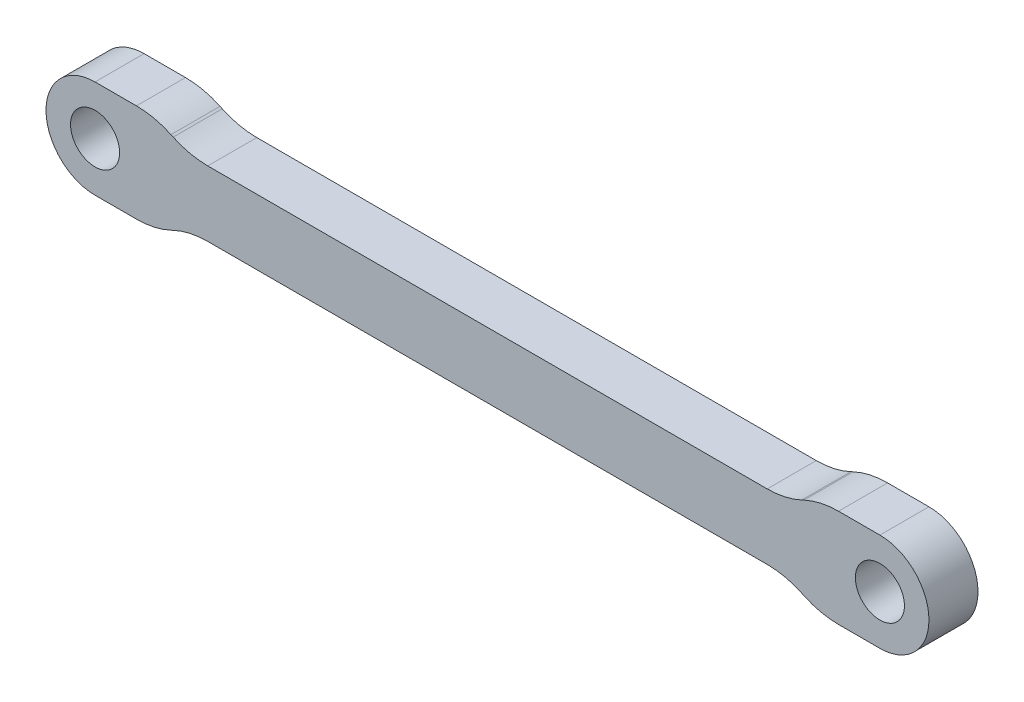
ISO-10303-21;
HEADER;
FILE_DESCRIPTION(('STEP AP214'),'2;1');
FILE_NAME('part.step','',(''),(''),'','','');
FILE_SCHEMA(('AUTOMOTIVE_DESIGN { 1 0 10303 214 1 1 1 1 }'));
ENDSEC;
DATA;
#1=APPLICATION_CONTEXT('core data for automotive mechanical design processes');
#2=APPLICATION_PROTOCOL_DEFINITION('international standard','automotive_design',2000,#1);
#3=PRODUCT_CONTEXT('',#1,'mechanical');
#4=PRODUCT('Part','Part','',(#3));
#5=PRODUCT_RELATED_PRODUCT_CATEGORY('part','',(#4));
#6=PRODUCT_DEFINITION_FORMATION('','',#4);
#7=PRODUCT_DEFINITION_CONTEXT('part definition',#1,'design');
#8=PRODUCT_DEFINITION('design','',#6,#7);
#9=PRODUCT_DEFINITION_SHAPE('','',#8);
#10=(LENGTH_UNIT() NAMED_UNIT(*) SI_UNIT(.MILLI.,.METRE.));
#11=(NAMED_UNIT(*) PLANE_ANGLE_UNIT() SI_UNIT($,.RADIAN.));
#12=(NAMED_UNIT(*) SI_UNIT($,.STERADIAN.) SOLID_ANGLE_UNIT());
#13=UNCERTAINTY_MEASURE_WITH_UNIT(LENGTH_MEASURE(1.E-05),#10,'distance_accuracy_value','');
#14=(GEOMETRIC_REPRESENTATION_CONTEXT(3) GLOBAL_UNCERTAINTY_ASSIGNED_CONTEXT((#13)) GLOBAL_UNIT_ASSIGNED_CONTEXT((#10,
#11,#12)) REPRESENTATION_CONTEXT('',''));
#15=CARTESIAN_POINT('',(0.,0.,0.));
#16=DIRECTION('',(0.,0.,1.));
#17=DIRECTION('',(1.,0.,0.));
#18=AXIS2_PLACEMENT_3D('',#15,#16,#17);
#19=CARTESIAN_POINT('',(0.,-6.,6.));
#20=DIRECTION('',(0.,1.,0.));
#21=DIRECTION('',(0.,0.,1.));
#22=AXIS2_PLACEMENT_3D('',#19,#20,#21);
#23=PLANE('',#22);
#24=DIRECTION('',(1.,0.,0.));
#25=VECTOR('',#24,1.);
#26=CARTESIAN_POINT('',(0.,-6.,6.));
#27=LINE('',#26,#25);
#28=CARTESIAN_POINT('',(90.9394812289775,-6.,6.));
#29=VERTEX_POINT('',#28);
#30=CARTESIAN_POINT('',(96.,-6.,6.));
#31=VERTEX_POINT('',#30);
#32=EDGE_CURVE('E183',#29,#31,#27,.T.);
#33=ORIENTED_EDGE('',*,*,#32,.F.);
#34=DIRECTION('',(0.,0.,1.));
#35=VECTOR('',#34,1.);
#36=CARTESIAN_POINT('',(90.9394812289775,-6.,0.));
#37=LINE('',#36,#35);
#38=CARTESIAN_POINT('',(90.9394812289775,-6.,0.));
#39=VERTEX_POINT('',#38);
#40=EDGE_CURVE('E259',#29,#39,#37,.F.);
#41=ORIENTED_EDGE('',*,*,#40,.T.);
#42=DIRECTION('',(1.,0.,0.));
#43=VECTOR('',#42,1.);
#44=CARTESIAN_POINT('',(0.,-6.,0.));
#45=LINE('',#44,#43);
#46=CARTESIAN_POINT('',(96.,-6.,0.));
#47=VERTEX_POINT('',#46);
#48=EDGE_CURVE('E336',#39,#47,#45,.T.);
#49=ORIENTED_EDGE('',*,*,#48,.T.);
#50=DIRECTION('',(0.,0.,-1.));
#51=VECTOR('',#50,1.);
#52=CARTESIAN_POINT('',(96.,-6.,6.));
#53=LINE('',#52,#51);
#54=EDGE_CURVE('E200',#31,#47,#53,.T.);
#55=ORIENTED_EDGE('',*,*,#54,.F.);
#56=EDGE_LOOP('',(#33,#41,#49,#55));
#57=FACE_BOUND('',#56,.T.);
#58=ADVANCED_FACE('F34',(#57),#23,.F.);
#59=CARTESIAN_POINT('',(0.,6.,6.));
#60=DIRECTION('',(0.,-1.,0.));
#61=DIRECTION('',(0.,0.,-1.));
#62=AXIS2_PLACEMENT_3D('',#59,#60,#61);
#63=PLANE('',#62);
#64=DIRECTION('',(-1.,0.,0.));
#65=VECTOR('',#64,1.);
#66=CARTESIAN_POINT('',(0.,6.,6.));
#67=LINE('',#66,#65);
#68=CARTESIAN_POINT('',(5.06051877102256,6.,6.));
#69=VERTEX_POINT('',#68);
#70=CARTESIAN_POINT('',(0.,6.,6.));
#71=VERTEX_POINT('',#70);
#72=EDGE_CURVE('E190',#69,#71,#67,.T.);
#73=ORIENTED_EDGE('',*,*,#72,.F.);
#74=DIRECTION('',(0.,0.,1.));
#75=VECTOR('',#74,1.);
#76=CARTESIAN_POINT('',(5.06051877102256,6.,0.));
#77=LINE('',#76,#75);
#78=CARTESIAN_POINT('',(5.06051877102256,6.,0.));
#79=VERTEX_POINT('',#78);
#80=EDGE_CURVE('E278',#69,#79,#77,.F.);
#81=ORIENTED_EDGE('',*,*,#80,.T.);
#82=DIRECTION('',(-1.,0.,0.));
#83=VECTOR('',#82,1.);
#84=CARTESIAN_POINT('',(0.,6.,0.));
#85=LINE('',#84,#83);
#86=CARTESIAN_POINT('',(0.,6.,0.));
#87=VERTEX_POINT('',#86);
#88=EDGE_CURVE('E341',#79,#87,#85,.T.);
#89=ORIENTED_EDGE('',*,*,#88,.T.);
#90=DIRECTION('',(0.,0.,-1.));
#91=VECTOR('',#90,1.);
#92=CARTESIAN_POINT('',(0.,6.,6.));
#93=LINE('',#92,#91);
#94=EDGE_CURVE('E334',#71,#87,#93,.T.);
#95=ORIENTED_EDGE('',*,*,#94,.F.);
#96=EDGE_LOOP('',(#73,#81,#89,#95));
#97=FACE_BOUND('',#96,.T.);
#98=ADVANCED_FACE('F398',(#97),#63,.F.);
#99=CARTESIAN_POINT('',(0.,0.,6.));
#100=DIRECTION('',(0.,0.,1.));
#101=DIRECTION('',(1.,0.,0.));
#102=AXIS2_PLACEMENT_3D('',#99,#100,#101);
#103=PLANE('',#102);
#104=CARTESIAN_POINT('',(0.,-6.,6.));
#105=VERTEX_POINT('',#104);
#106=CARTESIAN_POINT('',(5.06051877102256,-6.,6.));
#107=VERTEX_POINT('',#106);
#108=EDGE_CURVE('E172',#105,#107,#27,.T.);
#109=ORIENTED_EDGE('',*,*,#108,.T.);
#110=CARTESIAN_POINT('',(5.06051877102256,4.,6.));
#111=DIRECTION('',(0.,0.,1.));
#112=DIRECTION('',(1.,0.,0.));
#113=AXIS2_PLACEMENT_3D('',#110,#111,#112);
#114=CIRCLE('',#113,10.);
#115=CARTESIAN_POINT('',(9.28670138842951,-5.06307787036652,6.));
#116=VERTEX_POINT('',#115);
#117=EDGE_CURVE('E246',#107,#116,#114,.T.);
#118=ORIENTED_EDGE('',*,*,#117,.T.);
#119=DIRECTION('',(-0.906307787036652,-0.422618261740695,0.));
#120=VECTOR('',#119,1.);
#121=CARTESIAN_POINT('',(3.59793373438054,-7.71579379291397,6.));
#122=LINE('',#121,#120);
#123=CARTESIAN_POINT('',(9.55724324749352,-4.93692212963348,6.));
#124=VERTEX_POINT('',#123);
#125=EDGE_CURVE('E203',#116,#124,#122,.F.);
#126=ORIENTED_EDGE('',*,*,#125,.T.);
#127=CARTESIAN_POINT('',(13.7834258649005,-14.,6.));
#128=DIRECTION('',(0.,0.,1.));
#129=DIRECTION('',(1.,0.,0.));
#130=AXIS2_PLACEMENT_3D('',#127,#128,#129);
#131=CIRCLE('',#130,10.);
#132=CARTESIAN_POINT('',(13.7834258649005,-4.,6.));
#133=VERTEX_POINT('',#132);
#134=EDGE_CURVE('E283',#124,#133,#131,.F.);
#135=ORIENTED_EDGE('',*,*,#134,.T.);
#136=DIRECTION('',(-1.,0.,0.));
#137=VECTOR('',#136,1.);
#138=CARTESIAN_POINT('',(18.,-4.,6.));
#139=LINE('',#138,#137);
#140=CARTESIAN_POINT('',(82.2165741350996,-4.,6.));
#141=VERTEX_POINT('',#140);
#142=EDGE_CURVE('E310',#141,#133,#139,.T.);
#143=ORIENTED_EDGE('',*,*,#142,.F.);
#144=CARTESIAN_POINT('',(82.2165741350996,-14.,6.));
#145=DIRECTION('',(0.,0.,1.));
#146=DIRECTION('',(1.,0.,0.));
#147=AXIS2_PLACEMENT_3D('',#144,#145,#146);
#148=CIRCLE('',#147,10.);
#149=CARTESIAN_POINT('',(86.4427567525065,-4.93692212963347,6.));
#150=VERTEX_POINT('',#149);
#151=EDGE_CURVE('E285',#141,#150,#148,.F.);
#152=ORIENTED_EDGE('',*,*,#151,.T.);
#153=DIRECTION('',(-0.906307787036653,0.422618261740693,0.));
#154=VECTOR('',#153,1.);
#155=CARTESIAN_POINT('',(13.5482610006651,29.0543394767966,6.));
#156=LINE('',#155,#154);
#157=CARTESIAN_POINT('',(86.7132986115706,-5.06307787036654,6.));
#158=VERTEX_POINT('',#157);
#159=EDGE_CURVE('E212',#150,#158,#156,.F.);
#160=ORIENTED_EDGE('',*,*,#159,.T.);
#161=CARTESIAN_POINT('',(90.9394812289775,4.,6.));
#162=DIRECTION('',(0.,0.,1.));
#163=DIRECTION('',(1.,0.,0.));
#164=AXIS2_PLACEMENT_3D('',#161,#162,#163);
#165=CIRCLE('',#164,10.);
#166=EDGE_CURVE('E244',#158,#29,#165,.T.);
#167=ORIENTED_EDGE('',*,*,#166,.T.);
#168=ORIENTED_EDGE('',*,*,#32,.T.);
#169=CARTESIAN_POINT('',(96.,0.,6.));
#170=DIRECTION('',(0.,0.,1.));
#171=DIRECTION('',(1.,0.,0.));
#172=AXIS2_PLACEMENT_3D('',#169,#170,#171);
#173=CIRCLE('',#172,6.);
#174=CARTESIAN_POINT('',(96.,6.,6.));
#175=VERTEX_POINT('',#174);
#176=EDGE_CURVE('E182',#31,#175,#173,.T.);
#177=ORIENTED_EDGE('',*,*,#176,.T.);
#178=CARTESIAN_POINT('',(90.9394812289774,6.,6.));
#179=VERTEX_POINT('',#178);
#180=EDGE_CURVE('E331',#175,#179,#67,.T.);
#181=ORIENTED_EDGE('',*,*,#180,.T.);
#182=CARTESIAN_POINT('',(90.9394812289774,-4.,6.));
#183=DIRECTION('',(0.,0.,1.));
#184=DIRECTION('',(1.,0.,0.));
#185=AXIS2_PLACEMENT_3D('',#182,#183,#184);
#186=CIRCLE('',#185,10.);
#187=CARTESIAN_POINT('',(86.7132986115705,5.06307787036651,6.));
#188=VERTEX_POINT('',#187);
#189=EDGE_CURVE('E242',#179,#188,#186,.T.);
#190=ORIENTED_EDGE('',*,*,#189,.T.);
#191=DIRECTION('',(0.906307787036652,0.422618261740696,0.));
#192=VECTOR('',#191,1.);
#193=CARTESIAN_POINT('',(13.5482610006653,-29.0543394767967,6.));
#194=LINE('',#193,#192);
#195=CARTESIAN_POINT('',(86.4427567525065,4.9369221296335,6.));
#196=VERTEX_POINT('',#195);
#197=EDGE_CURVE('E215',#188,#196,#194,.F.);
#198=ORIENTED_EDGE('',*,*,#197,.T.);
#199=CARTESIAN_POINT('',(82.2165741350995,14.,6.));
#200=DIRECTION('',(0.,0.,1.));
#201=DIRECTION('',(1.,0.,0.));
#202=AXIS2_PLACEMENT_3D('',#199,#200,#201);
#203=CIRCLE('',#202,10.);
#204=CARTESIAN_POINT('',(82.2165741350995,4.,6.));
#205=VERTEX_POINT('',#204);
#206=EDGE_CURVE('E291',#196,#205,#203,.F.);
#207=ORIENTED_EDGE('',*,*,#206,.T.);
#208=DIRECTION('',(1.,0.,0.));
#209=VECTOR('',#208,1.);
#210=CARTESIAN_POINT('',(78.,4.,6.));
#211=LINE('',#210,#209);
#212=CARTESIAN_POINT('',(13.7834258649005,4.,6.));
#213=VERTEX_POINT('',#212);
#214=EDGE_CURVE('E295',#213,#205,#211,.T.);
#215=ORIENTED_EDGE('',*,*,#214,.F.);
#216=CARTESIAN_POINT('',(13.7834258649005,14.,6.));
#217=DIRECTION('',(0.,0.,1.));
#218=DIRECTION('',(1.,0.,0.));
#219=AXIS2_PLACEMENT_3D('',#216,#217,#218);
#220=CIRCLE('',#219,10.);
#221=CARTESIAN_POINT('',(9.55724324749353,4.93692212963348,6.));
#222=VERTEX_POINT('',#221);
#223=EDGE_CURVE('E42',#213,#222,#220,.F.);
#224=ORIENTED_EDGE('',*,*,#223,.T.);
#225=DIRECTION('',(0.906307787036652,-0.422618261740695,0.));
#226=VECTOR('',#225,1.);
#227=CARTESIAN_POINT('',(3.59793373438054,7.71579379291397,6.));
#228=LINE('',#227,#226);
#229=CARTESIAN_POINT('',(9.28670138842951,5.06307787036652,6.));
#230=VERTEX_POINT('',#229);
#231=EDGE_CURVE('E199',#222,#230,#228,.F.);
#232=ORIENTED_EDGE('',*,*,#231,.T.);
#233=CARTESIAN_POINT('',(5.06051877102256,-4.,6.));
#234=DIRECTION('',(0.,0.,1.));
#235=DIRECTION('',(1.,0.,0.));
#236=AXIS2_PLACEMENT_3D('',#233,#234,#235);
#237=CIRCLE('',#236,10.);
#238=EDGE_CURVE('E240',#230,#69,#237,.T.);
#239=ORIENTED_EDGE('',*,*,#238,.T.);
#240=ORIENTED_EDGE('',*,*,#72,.T.);
#241=CARTESIAN_POINT('',(0.,0.,6.));
#242=DIRECTION('',(0.,0.,1.));
#243=DIRECTION('',(1.,0.,0.));
#244=AXIS2_PLACEMENT_3D('',#241,#242,#243);
#245=CIRCLE('',#244,6.);
#246=EDGE_CURVE('E186',#71,#105,#245,.T.);
#247=ORIENTED_EDGE('',*,*,#246,.T.);
#248=EDGE_LOOP('',(#109,#118,#126,#135,#143,#152,#160,#167,#168,#177,#181,#190,#198,#207,#215,
#224,#232,#239,#240,#247));
#249=FACE_BOUND('',#248,.T.);
#250=CARTESIAN_POINT('',(0.,0.,6.));
#251=DIRECTION('',(0.,0.,1.));
#252=DIRECTION('',(1.,0.,0.));
#253=AXIS2_PLACEMENT_3D('',#250,#251,#252);
#254=CIRCLE('',#253,3.);
#255=CARTESIAN_POINT('',(3.,0.,6.));
#256=VERTEX_POINT('',#255);
#257=EDGE_CURVE('E325',#256,#256,#254,.T.);
#258=ORIENTED_EDGE('',*,*,#257,.F.);
#259=EDGE_LOOP('',(#258));
#260=FACE_BOUND('',#259,.T.);
#261=CARTESIAN_POINT('',(96.,0.,6.));
#262=DIRECTION('',(0.,0.,1.));
#263=DIRECTION('',(1.,0.,0.));
#264=AXIS2_PLACEMENT_3D('',#261,#262,#263);
#265=CIRCLE('',#264,3.00000000000001);
#266=CARTESIAN_POINT('',(99.,0.,6.));
#267=VERTEX_POINT('',#266);
#268=EDGE_CURVE('E318',#267,#267,#265,.T.);
#269=ORIENTED_EDGE('',*,*,#268,.F.);
#270=EDGE_LOOP('',(#269));
#271=FACE_BOUND('',#270,.T.);
#272=ADVANCED_FACE('F187',(#249,#260,#271),#103,.T.);
#273=CARTESIAN_POINT('',(0.,0.,0.));
#274=DIRECTION('',(0.,0.,1.));
#275=DIRECTION('',(1.,0.,0.));
#276=AXIS2_PLACEMENT_3D('',#273,#274,#275);
#277=PLANE('',#276);
#278=DIRECTION('',(0.906307787036652,0.422618261740695,0.));
#279=VECTOR('',#278,1.);
#280=CARTESIAN_POINT('',(7.27746539745193,-6.,0.));
#281=LINE('',#280,#279);
#282=CARTESIAN_POINT('',(9.55724324749352,-4.93692212963348,0.));
#283=VERTEX_POINT('',#282);
#284=CARTESIAN_POINT('',(9.28670138842951,-5.06307787036652,0.));
#285=VERTEX_POINT('',#284);
#286=EDGE_CURVE('E220',#283,#285,#281,.F.);
#287=ORIENTED_EDGE('',*,*,#286,.T.);
#288=CARTESIAN_POINT('',(5.06051877102256,4.,0.));
#289=DIRECTION('',(0.,0.,1.));
#290=DIRECTION('',(1.,0.,0.));
#291=AXIS2_PLACEMENT_3D('',#288,#289,#290);
#292=CIRCLE('',#291,10.);
#293=CARTESIAN_POINT('',(5.06051877102256,-6.,0.));
#294=VERTEX_POINT('',#293);
#295=EDGE_CURVE('E253',#285,#294,#292,.F.);
#296=ORIENTED_EDGE('',*,*,#295,.T.);
#297=CARTESIAN_POINT('',(0.,-6.,0.));
#298=VERTEX_POINT('',#297);
#299=EDGE_CURVE('E337',#298,#294,#45,.T.);
#300=ORIENTED_EDGE('',*,*,#299,.F.);
#301=CARTESIAN_POINT('',(0.,0.,0.));
#302=DIRECTION('',(0.,0.,1.));
#303=DIRECTION('',(1.,0.,0.));
#304=AXIS2_PLACEMENT_3D('',#301,#302,#303);
#305=CIRCLE('',#304,6.);
#306=EDGE_CURVE('E198',#87,#298,#305,.T.);
#307=ORIENTED_EDGE('',*,*,#306,.F.);
#308=ORIENTED_EDGE('',*,*,#88,.F.);
#309=CARTESIAN_POINT('',(5.06051877102256,-4.,0.));
#310=DIRECTION('',(0.,0.,1.));
#311=DIRECTION('',(1.,0.,0.));
#312=AXIS2_PLACEMENT_3D('',#309,#310,#311);
#313=CIRCLE('',#312,10.);
#314=CARTESIAN_POINT('',(9.28670138842951,5.06307787036652,0.));
#315=VERTEX_POINT('',#314);
#316=EDGE_CURVE('E56',#79,#315,#313,.F.);
#317=ORIENTED_EDGE('',*,*,#316,.T.);
#318=DIRECTION('',(-0.906307787036652,0.422618261740695,0.));
#319=VECTOR('',#318,1.);
#320=CARTESIAN_POINT('',(7.27746539745193,6.,0.));
#321=LINE('',#320,#319);
#322=CARTESIAN_POINT('',(9.55724324749353,4.93692212963348,0.));
#323=VERTEX_POINT('',#322);
#324=EDGE_CURVE('E218',#315,#323,#321,.F.);
#325=ORIENTED_EDGE('',*,*,#324,.T.);
#326=CARTESIAN_POINT('',(13.7834258649005,14.,0.));
#327=DIRECTION('',(0.,0.,1.));
#328=DIRECTION('',(1.,0.,0.));
#329=AXIS2_PLACEMENT_3D('',#326,#327,#328);
#330=CIRCLE('',#329,10.);
#331=CARTESIAN_POINT('',(13.7834258649005,4.,0.));
#332=VERTEX_POINT('',#331);
#333=EDGE_CURVE('E11',#323,#332,#330,.T.);
#334=ORIENTED_EDGE('',*,*,#333,.T.);
#335=DIRECTION('',(1.,0.,0.));
#336=VECTOR('',#335,1.);
#337=CARTESIAN_POINT('',(78.,4.,0.));
#338=LINE('',#337,#336);
#339=CARTESIAN_POINT('',(82.2165741350995,4.,0.));
#340=VERTEX_POINT('',#339);
#341=EDGE_CURVE('E306',#332,#340,#338,.T.);
#342=ORIENTED_EDGE('',*,*,#341,.T.);
#343=CARTESIAN_POINT('',(82.2165741350995,14.,0.));
#344=DIRECTION('',(0.,0.,1.));
#345=DIRECTION('',(1.,0.,0.));
#346=AXIS2_PLACEMENT_3D('',#343,#344,#345);
#347=CIRCLE('',#346,10.);
#348=CARTESIAN_POINT('',(86.4427567525065,4.93692212963349,0.));
#349=VERTEX_POINT('',#348);
#350=EDGE_CURVE('E289',#340,#349,#347,.T.);
#351=ORIENTED_EDGE('',*,*,#350,.T.);
#352=DIRECTION('',(-0.906307787036652,-0.422618261740696,0.));
#353=VECTOR('',#352,1.);
#354=CARTESIAN_POINT('',(88.7225346025481,6.,0.));
#355=LINE('',#354,#353);
#356=CARTESIAN_POINT('',(86.7132986115705,5.06307787036651,0.));
#357=VERTEX_POINT('',#356);
#358=EDGE_CURVE('E226',#349,#357,#355,.F.);
#359=ORIENTED_EDGE('',*,*,#358,.T.);
#360=CARTESIAN_POINT('',(90.9394812289774,-4.,0.));
#361=DIRECTION('',(0.,0.,1.));
#362=DIRECTION('',(1.,0.,0.));
#363=AXIS2_PLACEMENT_3D('',#360,#361,#362);
#364=CIRCLE('',#363,10.);
#365=CARTESIAN_POINT('',(90.9394812289774,6.,0.));
#366=VERTEX_POINT('',#365);
#367=EDGE_CURVE('E249',#357,#366,#364,.F.);
#368=ORIENTED_EDGE('',*,*,#367,.T.);
#369=CARTESIAN_POINT('',(96.,6.,0.));
#370=VERTEX_POINT('',#369);
#371=EDGE_CURVE('E194',#370,#366,#85,.T.);
#372=ORIENTED_EDGE('',*,*,#371,.F.);
#373=CARTESIAN_POINT('',(96.,0.,0.));
#374=DIRECTION('',(0.,0.,1.));
#375=DIRECTION('',(1.,0.,0.));
#376=AXIS2_PLACEMENT_3D('',#373,#374,#375);
#377=CIRCLE('',#376,6.);
#378=EDGE_CURVE('E339',#47,#370,#377,.T.);
#379=ORIENTED_EDGE('',*,*,#378,.F.);
#380=ORIENTED_EDGE('',*,*,#48,.F.);
#381=CARTESIAN_POINT('',(90.9394812289775,4.,0.));
#382=DIRECTION('',(0.,0.,1.));
#383=DIRECTION('',(1.,0.,0.));
#384=AXIS2_PLACEMENT_3D('',#381,#382,#383);
#385=CIRCLE('',#384,10.);
#386=CARTESIAN_POINT('',(86.7132986115706,-5.06307787036653,0.));
#387=VERTEX_POINT('',#386);
#388=EDGE_CURVE('E251',#39,#387,#385,.F.);
#389=ORIENTED_EDGE('',*,*,#388,.T.);
#390=DIRECTION('',(0.906307787036653,-0.422618261740693,0.));
#391=VECTOR('',#390,1.);
#392=CARTESIAN_POINT('',(88.7225346025481,-6.,0.));
#393=LINE('',#392,#391);
#394=CARTESIAN_POINT('',(86.4427567525065,-4.93692212963347,0.));
#395=VERTEX_POINT('',#394);
#396=EDGE_CURVE('E223',#387,#395,#393,.F.);
#397=ORIENTED_EDGE('',*,*,#396,.T.);
#398=CARTESIAN_POINT('',(82.2165741350996,-14.,0.));
#399=DIRECTION('',(0.,0.,1.));
#400=DIRECTION('',(1.,0.,0.));
#401=AXIS2_PLACEMENT_3D('',#398,#399,#400);
#402=CIRCLE('',#401,10.);
#403=CARTESIAN_POINT('',(82.2165741350996,-4.,0.));
#404=VERTEX_POINT('',#403);
#405=EDGE_CURVE('E287',#395,#404,#402,.T.);
#406=ORIENTED_EDGE('',*,*,#405,.T.);
#407=DIRECTION('',(-1.,0.,0.));
#408=VECTOR('',#407,1.);
#409=CARTESIAN_POINT('',(18.,-4.,0.));
#410=LINE('',#409,#408);
#411=CARTESIAN_POINT('',(13.7834258649005,-4.,0.));
#412=VERTEX_POINT('',#411);
#413=EDGE_CURVE('E313',#404,#412,#410,.T.);
#414=ORIENTED_EDGE('',*,*,#413,.T.);
#415=CARTESIAN_POINT('',(13.7834258649005,-14.,0.));
#416=DIRECTION('',(0.,0.,1.));
#417=DIRECTION('',(1.,0.,0.));
#418=AXIS2_PLACEMENT_3D('',#415,#416,#417);
#419=CIRCLE('',#418,10.);
#420=EDGE_CURVE('E281',#412,#283,#419,.T.);
#421=ORIENTED_EDGE('',*,*,#420,.T.);
#422=EDGE_LOOP('',(#287,#296,#300,#307,#308,#317,#325,#334,#342,#351,#359,#368,#372,#379,#380,
#389,#397,#406,#414,#421));
#423=FACE_BOUND('',#422,.T.);
#424=CARTESIAN_POINT('',(0.,0.,0.));
#425=DIRECTION('',(0.,0.,1.));
#426=DIRECTION('',(1.,0.,0.));
#427=AXIS2_PLACEMENT_3D('',#424,#425,#426);
#428=CIRCLE('',#427,3.);
#429=CARTESIAN_POINT('',(3.,0.,0.));
#430=VERTEX_POINT('',#429);
#431=EDGE_CURVE('E321',#430,#430,#428,.T.);
#432=ORIENTED_EDGE('',*,*,#431,.T.);
#433=EDGE_LOOP('',(#432));
#434=FACE_BOUND('',#433,.T.);
#435=CARTESIAN_POINT('',(96.,0.,0.));
#436=DIRECTION('',(0.,0.,1.));
#437=DIRECTION('',(1.,0.,0.));
#438=AXIS2_PLACEMENT_3D('',#435,#436,#437);
#439=CIRCLE('',#438,3.00000000000001);
#440=CARTESIAN_POINT('',(99.,0.,0.));
#441=VERTEX_POINT('',#440);
#442=EDGE_CURVE('E322',#441,#441,#439,.T.);
#443=ORIENTED_EDGE('',*,*,#442,.T.);
#444=EDGE_LOOP('',(#443));
#445=FACE_BOUND('',#444,.T.);
#446=ADVANCED_FACE('F304',(#423,#434,#445),#277,.F.);
#447=CARTESIAN_POINT('',(0.,0.,6.));
#448=DIRECTION('',(0.,0.,-1.));
#449=DIRECTION('',(-1.,0.,0.));
#450=AXIS2_PLACEMENT_3D('',#447,#448,#449);
#451=CYLINDRICAL_SURFACE('',#450,6.);
#452=ORIENTED_EDGE('',*,*,#306,.T.);
#453=DIRECTION('',(0.,0.,-1.));
#454=VECTOR('',#453,1.);
#455=CARTESIAN_POINT('',(0.,-6.,6.));
#456=LINE('',#455,#454);
#457=EDGE_CURVE('E177',#105,#298,#456,.T.);
#458=ORIENTED_EDGE('',*,*,#457,.F.);
#459=ORIENTED_EDGE('',*,*,#246,.F.);
#460=ORIENTED_EDGE('',*,*,#94,.T.);
#461=EDGE_LOOP('',(#452,#458,#459,#460));
#462=FACE_BOUND('',#461,.T.);
#463=ADVANCED_FACE('F196',(#462),#451,.T.);
#464=ORIENTED_EDGE('',*,*,#299,.T.);
#465=DIRECTION('',(0.,0.,-1.));
#466=VECTOR('',#465,1.);
#467=CARTESIAN_POINT('',(5.06051877102256,-6.,6.));
#468=LINE('',#467,#466);
#469=EDGE_CURVE('E180',#294,#107,#468,.F.);
#470=ORIENTED_EDGE('',*,*,#469,.T.);
#471=ORIENTED_EDGE('',*,*,#108,.F.);
#472=ORIENTED_EDGE('',*,*,#457,.T.);
#473=EDGE_LOOP('',(#464,#470,#471,#472));
#474=FACE_BOUND('',#473,.T.);
#475=ADVANCED_FACE('F175',(#474),#23,.F.);
#476=CARTESIAN_POINT('',(96.,0.,6.));
#477=DIRECTION('',(0.,0.,-1.));
#478=DIRECTION('',(-1.,0.,0.));
#479=AXIS2_PLACEMENT_3D('',#476,#477,#478);
#480=CYLINDRICAL_SURFACE('',#479,6.);
#481=ORIENTED_EDGE('',*,*,#378,.T.);
#482=DIRECTION('',(0.,0.,-1.));
#483=VECTOR('',#482,1.);
#484=CARTESIAN_POINT('',(96.,6.,6.));
#485=LINE('',#484,#483);
#486=EDGE_CURVE('E206',#175,#370,#485,.T.);
#487=ORIENTED_EDGE('',*,*,#486,.F.);
#488=ORIENTED_EDGE('',*,*,#176,.F.);
#489=ORIENTED_EDGE('',*,*,#54,.T.);
#490=EDGE_LOOP('',(#481,#487,#488,#489));
#491=FACE_BOUND('',#490,.T.);
#492=ADVANCED_FACE('F363',(#491),#480,.T.);
#493=ORIENTED_EDGE('',*,*,#371,.T.);
#494=DIRECTION('',(0.,0.,-1.));
#495=VECTOR('',#494,1.);
#496=CARTESIAN_POINT('',(90.9394812289774,6.,6.));
#497=LINE('',#496,#495);
#498=EDGE_CURVE('E272',#366,#179,#497,.F.);
#499=ORIENTED_EDGE('',*,*,#498,.T.);
#500=ORIENTED_EDGE('',*,*,#180,.F.);
#501=ORIENTED_EDGE('',*,*,#486,.T.);
#502=EDGE_LOOP('',(#493,#499,#500,#501));
#503=FACE_BOUND('',#502,.T.);
#504=ADVANCED_FACE('F349',(#503),#63,.F.);
#505=CARTESIAN_POINT('',(0.,0.,6.));
#506=DIRECTION('',(0.,0.,-1.));
#507=DIRECTION('',(-1.,0.,0.));
#508=AXIS2_PLACEMENT_3D('',#505,#506,#507);
#509=CYLINDRICAL_SURFACE('',#508,3.);
#510=ORIENTED_EDGE('',*,*,#257,.T.);
#511=EDGE_LOOP('',(#510));
#512=FACE_BOUND('',#511,.T.);
#513=ORIENTED_EDGE('',*,*,#431,.F.);
#514=EDGE_LOOP('',(#513));
#515=FACE_BOUND('',#514,.T.);
#516=ADVANCED_FACE('F540',(#512,#515),#509,.F.);
#517=CARTESIAN_POINT('',(96.,0.,6.));
#518=DIRECTION('',(0.,0.,-1.));
#519=DIRECTION('',(-1.,0.,0.));
#520=AXIS2_PLACEMENT_3D('',#517,#518,#519);
#521=CYLINDRICAL_SURFACE('',#520,3.00000000000001);
#522=ORIENTED_EDGE('',*,*,#268,.T.);
#523=EDGE_LOOP('',(#522));
#524=FACE_BOUND('',#523,.T.);
#525=ORIENTED_EDGE('',*,*,#442,.F.);
#526=EDGE_LOOP('',(#525));
#527=FACE_BOUND('',#526,.T.);
#528=ADVANCED_FACE('F521',(#524,#527),#521,.F.);
#529=CARTESIAN_POINT('',(78.,4.,0.));
#530=DIRECTION('',(0.,-1.,0.));
#531=DIRECTION('',(0.,0.,-1.));
#532=AXIS2_PLACEMENT_3D('',#529,#530,#531);
#533=PLANE('',#532);
#534=ORIENTED_EDGE('',*,*,#214,.T.);
#535=DIRECTION('',(0.,0.,1.));
#536=VECTOR('',#535,1.);
#537=CARTESIAN_POINT('',(82.2165741350995,4.,0.));
#538=LINE('',#537,#536);
#539=EDGE_CURVE('E265',#205,#340,#538,.F.);
#540=ORIENTED_EDGE('',*,*,#539,.T.);
#541=ORIENTED_EDGE('',*,*,#341,.F.);
#542=DIRECTION('',(0.,0.,-1.));
#543=VECTOR('',#542,1.);
#544=CARTESIAN_POINT('',(13.7834258649005,4.,0.));
#545=LINE('',#544,#543);
#546=EDGE_CURVE('E262',#332,#213,#545,.F.);
#547=ORIENTED_EDGE('',*,*,#546,.T.);
#548=EDGE_LOOP('',(#534,#540,#541,#547));
#549=FACE_BOUND('',#548,.T.);
#550=ADVANCED_FACE('F308',(#549),#533,.F.);
#551=CARTESIAN_POINT('',(18.,-4.,0.));
#552=DIRECTION('',(0.,1.,0.));
#553=DIRECTION('',(0.,0.,1.));
#554=AXIS2_PLACEMENT_3D('',#551,#552,#553);
#555=PLANE('',#554);
#556=ORIENTED_EDGE('',*,*,#142,.T.);
#557=DIRECTION('',(0.,0.,1.));
#558=VECTOR('',#557,1.);
#559=CARTESIAN_POINT('',(13.7834258649005,-4.,0.));
#560=LINE('',#559,#558);
#561=EDGE_CURVE('E232',#133,#412,#560,.F.);
#562=ORIENTED_EDGE('',*,*,#561,.T.);
#563=ORIENTED_EDGE('',*,*,#413,.F.);
#564=DIRECTION('',(0.,0.,-1.));
#565=VECTOR('',#564,1.);
#566=CARTESIAN_POINT('',(82.2165741350996,-4.,0.));
#567=LINE('',#566,#565);
#568=EDGE_CURVE('E229',#404,#141,#567,.F.);
#569=ORIENTED_EDGE('',*,*,#568,.T.);
#570=EDGE_LOOP('',(#556,#562,#563,#569));
#571=FACE_BOUND('',#570,.T.);
#572=ADVANCED_FACE('F383',(#571),#555,.F.);
#573=CARTESIAN_POINT('',(88.7225346025481,6.,6.));
#574=DIRECTION('',(0.422618261740696,-0.906307787036652,0.));
#575=DIRECTION('',(0.,0.,1.));
#576=AXIS2_PLACEMENT_3D('',#573,#574,#575);
#577=PLANE('',#576);
#578=ORIENTED_EDGE('',*,*,#358,.F.);
#579=DIRECTION('',(0.,0.,-1.));
#580=VECTOR('',#579,1.);
#581=CARTESIAN_POINT('',(86.4427567525065,4.93692212963349,6.));
#582=LINE('',#581,#580);
#583=EDGE_CURVE('E270',#349,#196,#582,.F.);
#584=ORIENTED_EDGE('',*,*,#583,.T.);
#585=ORIENTED_EDGE('',*,*,#197,.F.);
#586=DIRECTION('',(0.,0.,1.));
#587=VECTOR('',#586,1.);
#588=CARTESIAN_POINT('',(86.7132986115705,5.06307787036651,0.));
#589=LINE('',#588,#587);
#590=EDGE_CURVE('E268',#188,#357,#589,.F.);
#591=ORIENTED_EDGE('',*,*,#590,.T.);
#592=EDGE_LOOP('',(#578,#584,#585,#591));
#593=FACE_BOUND('',#592,.T.);
#594=ADVANCED_FACE('F423',(#593),#577,.F.);
#595=CARTESIAN_POINT('',(88.7225346025481,-6.,6.));
#596=DIRECTION('',(0.422618261740693,0.906307787036653,0.));
#597=DIRECTION('',(0.,0.,-1.));
#598=AXIS2_PLACEMENT_3D('',#595,#596,#597);
#599=PLANE('',#598);
#600=ORIENTED_EDGE('',*,*,#159,.F.);
#601=DIRECTION('',(0.,0.,1.));
#602=VECTOR('',#601,1.);
#603=CARTESIAN_POINT('',(86.4427567525065,-4.93692212963347,6.));
#604=LINE('',#603,#602);
#605=EDGE_CURVE('E257',#150,#395,#604,.F.);
#606=ORIENTED_EDGE('',*,*,#605,.T.);
#607=ORIENTED_EDGE('',*,*,#396,.F.);
#608=DIRECTION('',(0.,0.,-1.));
#609=VECTOR('',#608,1.);
#610=CARTESIAN_POINT('',(86.7132986115706,-5.06307787036653,6.));
#611=LINE('',#610,#609);
#612=EDGE_CURVE('E255',#387,#158,#611,.F.);
#613=ORIENTED_EDGE('',*,*,#612,.T.);
#614=EDGE_LOOP('',(#600,#606,#607,#613));
#615=FACE_BOUND('',#614,.T.);
#616=ADVANCED_FACE('F372',(#615),#599,.F.);
#617=CARTESIAN_POINT('',(7.27746539745193,-6.,6.));
#618=DIRECTION('',(-0.422618261740695,0.906307787036652,0.));
#619=DIRECTION('',(0.,0.,1.));
#620=AXIS2_PLACEMENT_3D('',#617,#618,#619);
#621=PLANE('',#620);
#622=ORIENTED_EDGE('',*,*,#286,.F.);
#623=DIRECTION('',(0.,0.,-1.));
#624=VECTOR('',#623,1.);
#625=CARTESIAN_POINT('',(9.55724324749352,-4.93692212963348,6.));
#626=LINE('',#625,#624);
#627=EDGE_CURVE('E237',#283,#124,#626,.F.);
#628=ORIENTED_EDGE('',*,*,#627,.T.);
#629=ORIENTED_EDGE('',*,*,#125,.F.);
#630=DIRECTION('',(0.,0.,1.));
#631=VECTOR('',#630,1.);
#632=CARTESIAN_POINT('',(9.28670138842951,-5.06307787036652,0.));
#633=LINE('',#632,#631);
#634=EDGE_CURVE('E235',#116,#285,#633,.F.);
#635=ORIENTED_EDGE('',*,*,#634,.T.);
#636=EDGE_LOOP('',(#622,#628,#629,#635));
#637=FACE_BOUND('',#636,.T.);
#638=ADVANCED_FACE('F392',(#637),#621,.F.);
#639=CARTESIAN_POINT('',(7.27746539745193,6.,6.));
#640=DIRECTION('',(-0.422618261740695,-0.906307787036652,0.));
#641=DIRECTION('',(0.,0.,-1.));
#642=AXIS2_PLACEMENT_3D('',#639,#640,#641);
#643=PLANE('',#642);
#644=ORIENTED_EDGE('',*,*,#231,.F.);
#645=DIRECTION('',(0.,0.,1.));
#646=VECTOR('',#645,1.);
#647=CARTESIAN_POINT('',(9.55724324749353,4.93692212963348,6.));
#648=LINE('',#647,#646);
#649=EDGE_CURVE('E49',#222,#323,#648,.F.);
#650=ORIENTED_EDGE('',*,*,#649,.T.);
#651=ORIENTED_EDGE('',*,*,#324,.F.);
#652=DIRECTION('',(0.,0.,-1.));
#653=VECTOR('',#652,1.);
#654=CARTESIAN_POINT('',(9.28670138842951,5.06307787036652,6.));
#655=LINE('',#654,#653);
#656=EDGE_CURVE('E275',#315,#230,#655,.F.);
#657=ORIENTED_EDGE('',*,*,#656,.T.);
#658=EDGE_LOOP('',(#644,#650,#651,#657));
#659=FACE_BOUND('',#658,.T.);
#660=ADVANCED_FACE('F298',(#659),#643,.F.);
#661=CARTESIAN_POINT('',(13.7834258649005,-14.,0.));
#662=DIRECTION('',(0.,0.,1.));
#663=DIRECTION('',(1.,0.,0.));
#664=AXIS2_PLACEMENT_3D('',#661,#662,#663);
#665=CYLINDRICAL_SURFACE('',#664,10.);
#666=ORIENTED_EDGE('',*,*,#134,.F.);
#667=ORIENTED_EDGE('',*,*,#627,.F.);
#668=ORIENTED_EDGE('',*,*,#420,.F.);
#669=ORIENTED_EDGE('',*,*,#561,.F.);
#670=EDGE_LOOP('',(#666,#667,#668,#669));
#671=FACE_BOUND('',#670,.T.);
#672=ADVANCED_FACE('F387',(#671),#665,.F.);
#673=CARTESIAN_POINT('',(5.06051877102256,4.,6.));
#674=DIRECTION('',(0.,0.,1.));
#675=DIRECTION('',(1.,0.,0.));
#676=AXIS2_PLACEMENT_3D('',#673,#674,#675);
#677=CYLINDRICAL_SURFACE('',#676,10.);
#678=ORIENTED_EDGE('',*,*,#295,.F.);
#679=ORIENTED_EDGE('',*,*,#634,.F.);
#680=ORIENTED_EDGE('',*,*,#117,.F.);
#681=ORIENTED_EDGE('',*,*,#469,.F.);
#682=EDGE_LOOP('',(#678,#679,#680,#681));
#683=FACE_BOUND('',#682,.T.);
#684=ADVANCED_FACE('F396',(#683),#677,.T.);
#685=CARTESIAN_POINT('',(82.2165741350996,-14.,0.));
#686=DIRECTION('',(0.,0.,-1.));
#687=DIRECTION('',(-1.,0.,0.));
#688=AXIS2_PLACEMENT_3D('',#685,#686,#687);
#689=CYLINDRICAL_SURFACE('',#688,10.);
#690=ORIENTED_EDGE('',*,*,#405,.F.);
#691=ORIENTED_EDGE('',*,*,#605,.F.);
#692=ORIENTED_EDGE('',*,*,#151,.F.);
#693=ORIENTED_EDGE('',*,*,#568,.F.);
#694=EDGE_LOOP('',(#690,#691,#692,#693));
#695=FACE_BOUND('',#694,.T.);
#696=ADVANCED_FACE('F378',(#695),#689,.F.);
#697=CARTESIAN_POINT('',(90.9394812289775,4.,6.));
#698=DIRECTION('',(0.,0.,-1.));
#699=DIRECTION('',(-1.,0.,0.));
#700=AXIS2_PLACEMENT_3D('',#697,#698,#699);
#701=CYLINDRICAL_SURFACE('',#700,10.);
#702=ORIENTED_EDGE('',*,*,#166,.F.);
#703=ORIENTED_EDGE('',*,*,#612,.F.);
#704=ORIENTED_EDGE('',*,*,#388,.F.);
#705=ORIENTED_EDGE('',*,*,#40,.F.);
#706=EDGE_LOOP('',(#702,#703,#704,#705));
#707=FACE_BOUND('',#706,.T.);
#708=ADVANCED_FACE('F375',(#707),#701,.T.);
#709=CARTESIAN_POINT('',(82.2165741350995,14.,0.));
#710=DIRECTION('',(0.,0.,1.));
#711=DIRECTION('',(1.,0.,0.));
#712=AXIS2_PLACEMENT_3D('',#709,#710,#711);
#713=CYLINDRICAL_SURFACE('',#712,10.);
#714=ORIENTED_EDGE('',*,*,#206,.F.);
#715=ORIENTED_EDGE('',*,*,#583,.F.);
#716=ORIENTED_EDGE('',*,*,#350,.F.);
#717=ORIENTED_EDGE('',*,*,#539,.F.);
#718=EDGE_LOOP('',(#714,#715,#716,#717));
#719=FACE_BOUND('',#718,.T.);
#720=ADVANCED_FACE('F441',(#719),#713,.F.);
#721=CARTESIAN_POINT('',(90.9394812289774,-4.,6.));
#722=DIRECTION('',(0.,0.,1.));
#723=DIRECTION('',(1.,0.,0.));
#724=AXIS2_PLACEMENT_3D('',#721,#722,#723);
#725=CYLINDRICAL_SURFACE('',#724,10.);
#726=ORIENTED_EDGE('',*,*,#367,.F.);
#727=ORIENTED_EDGE('',*,*,#590,.F.);
#728=ORIENTED_EDGE('',*,*,#189,.F.);
#729=ORIENTED_EDGE('',*,*,#498,.F.);
#730=EDGE_LOOP('',(#726,#727,#728,#729));
#731=FACE_BOUND('',#730,.T.);
#732=ADVANCED_FACE('F359',(#731),#725,.T.);
#733=CARTESIAN_POINT('',(13.7834258649005,14.,0.));
#734=DIRECTION('',(0.,0.,-1.));
#735=DIRECTION('',(-1.,0.,0.));
#736=AXIS2_PLACEMENT_3D('',#733,#734,#735);
#737=CYLINDRICAL_SURFACE('',#736,10.);
#738=ORIENTED_EDGE('',*,*,#333,.F.);
#739=ORIENTED_EDGE('',*,*,#649,.F.);
#740=ORIENTED_EDGE('',*,*,#223,.F.);
#741=ORIENTED_EDGE('',*,*,#546,.F.);
#742=EDGE_LOOP('',(#738,#739,#740,#741));
#743=FACE_BOUND('',#742,.T.);
#744=ADVANCED_FACE('F301',(#743),#737,.F.);
#745=CARTESIAN_POINT('',(5.06051877102256,-4.,6.));
#746=DIRECTION('',(0.,0.,-1.));
#747=DIRECTION('',(-1.,0.,0.));
#748=AXIS2_PLACEMENT_3D('',#745,#746,#747);
#749=CYLINDRICAL_SURFACE('',#748,10.);
#750=ORIENTED_EDGE('',*,*,#238,.F.);
#751=ORIENTED_EDGE('',*,*,#656,.F.);
#752=ORIENTED_EDGE('',*,*,#316,.F.);
#753=ORIENTED_EDGE('',*,*,#80,.F.);
#754=EDGE_LOOP('',(#750,#751,#752,#753));
#755=FACE_BOUND('',#754,.T.);
#756=ADVANCED_FACE('F36',(#755),#749,.T.);
#757=CLOSED_SHELL('',(#58,#98,#272,#446,#463,#475,#492,#504,#516,#528,#550,#572,#594,#616,#638,
#660,#672,#684,#696,#708,#720,#732,#744,#756));
#758=MANIFOLD_SOLID_BREP('B2',#757);
#759=ADVANCED_BREP_SHAPE_REPRESENTATION('',(#18,#758),#14);
#760=SHAPE_DEFINITION_REPRESENTATION(#9,#759);
ENDSEC;
END-ISO-10303-21;
